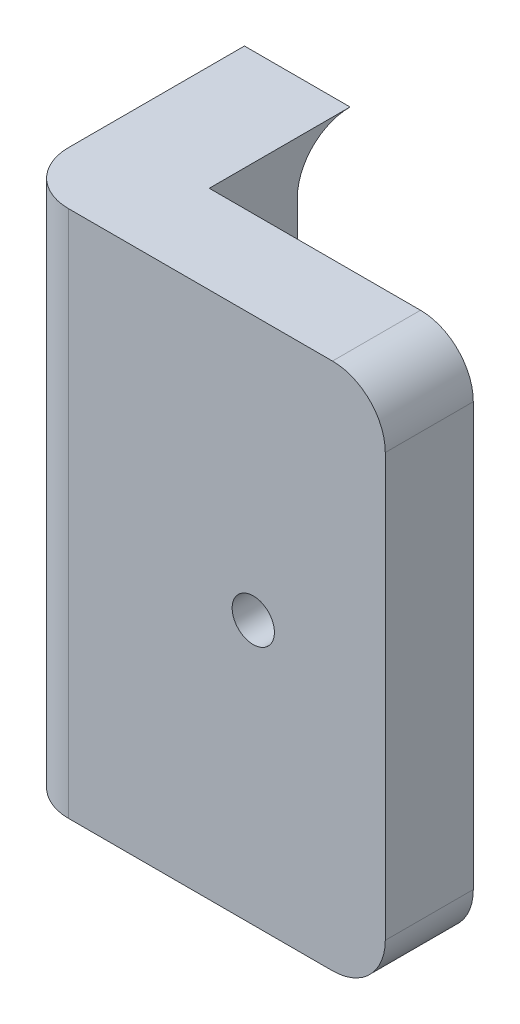
ISO-10303-21;
HEADER;
FILE_DESCRIPTION(('STEP AP214'),'2;1');
FILE_NAME('part.step','',(''),(''),'','','');
FILE_SCHEMA(('AUTOMOTIVE_DESIGN { 1 0 10303 214 1 1 1 1 }'));
ENDSEC;
DATA;
#1=APPLICATION_CONTEXT('core data for automotive mechanical design processes');
#2=APPLICATION_PROTOCOL_DEFINITION('international standard','automotive_design',2000,#1);
#3=PRODUCT_CONTEXT('',#1,'mechanical');
#4=PRODUCT('Part','Part','',(#3));
#5=PRODUCT_RELATED_PRODUCT_CATEGORY('part','',(#4));
#6=PRODUCT_DEFINITION_FORMATION('','',#4);
#7=PRODUCT_DEFINITION_CONTEXT('part definition',#1,'design');
#8=PRODUCT_DEFINITION('design','',#6,#7);
#9=PRODUCT_DEFINITION_SHAPE('','',#8);
#10=(LENGTH_UNIT() NAMED_UNIT(*) SI_UNIT(.MILLI.,.METRE.));
#11=(NAMED_UNIT(*) PLANE_ANGLE_UNIT() SI_UNIT($,.RADIAN.));
#12=(NAMED_UNIT(*) SI_UNIT($,.STERADIAN.) SOLID_ANGLE_UNIT());
#13=UNCERTAINTY_MEASURE_WITH_UNIT(LENGTH_MEASURE(1.E-05),#10,'distance_accuracy_value','');
#14=(GEOMETRIC_REPRESENTATION_CONTEXT(3) GLOBAL_UNCERTAINTY_ASSIGNED_CONTEXT((#13)) GLOBAL_UNIT_ASSIGNED_CONTEXT((#10,
#11,#12)) REPRESENTATION_CONTEXT('',''));
#15=CARTESIAN_POINT('',(0.,0.,0.));
#16=DIRECTION('',(0.,0.,1.));
#17=DIRECTION('',(1.,0.,0.));
#18=AXIS2_PLACEMENT_3D('',#15,#16,#17);
#19=CARTESIAN_POINT('',(6.,-33.0000000000001,-5.));
#20=DIRECTION('',(1.,0.,0.));
#21=DIRECTION('',(0.,0.,-1.));
#22=AXIS2_PLACEMENT_3D('',#19,#20,#21);
#23=PLANE('',#22);
#24=CARTESIAN_POINT('',(6.,-36.0000000000001,-3.));
#25=DIRECTION('',(1.,0.,0.));
#26=DIRECTION('',(0.,0.,-1.));
#27=AXIS2_PLACEMENT_3D('',#24,#25,#26);
#28=CIRCLE('',#27,3.);
#29=CARTESIAN_POINT('',(6.,-33.0000000000001,-3.));
#30=VERTEX_POINT('',#29);
#31=CARTESIAN_POINT('',(6.,-36.0000000000001,0.));
#32=VERTEX_POINT('',#31);
#33=EDGE_CURVE('E122',#30,#32,#28,.T.);
#34=ORIENTED_EDGE('',*,*,#33,.F.);
#35=DIRECTION('',(0.,0.,1.));
#36=VECTOR('',#35,1.);
#37=CARTESIAN_POINT('',(6.,-33.0000000000001,-5.));
#38=LINE('',#37,#36);
#39=CARTESIAN_POINT('',(6.,-33.0000000000001,5.));
#40=VERTEX_POINT('',#39);
#41=EDGE_CURVE('E166',#30,#40,#38,.T.);
#42=ORIENTED_EDGE('',*,*,#41,.T.);
#43=DIRECTION('',(0.,1.,0.));
#44=VECTOR('',#43,1.);
#45=CARTESIAN_POINT('',(6.,-63.0000000000001,5.));
#46=LINE('',#45,#44);
#47=CARTESIAN_POINT('',(6.,-63.0000000000001,5.));
#48=VERTEX_POINT('',#47);
#49=EDGE_CURVE('E145',#48,#40,#46,.T.);
#50=ORIENTED_EDGE('',*,*,#49,.F.);
#51=DIRECTION('',(0.,0.,1.));
#52=VECTOR('',#51,1.);
#53=CARTESIAN_POINT('',(6.,-63.0000000000001,-5.));
#54=LINE('',#53,#52);
#55=CARTESIAN_POINT('',(6.,-63.0000000000001,-3.));
#56=VERTEX_POINT('',#55);
#57=EDGE_CURVE('E167',#56,#48,#54,.T.);
#58=ORIENTED_EDGE('',*,*,#57,.F.);
#59=CARTESIAN_POINT('',(6.,-60.0000000000001,-3.));
#60=DIRECTION('',(1.,0.,0.));
#61=DIRECTION('',(0.,0.,-1.));
#62=AXIS2_PLACEMENT_3D('',#59,#60,#61);
#63=CIRCLE('',#62,3.);
#64=CARTESIAN_POINT('',(6.,-60.0000000000001,0.));
#65=VERTEX_POINT('',#64);
#66=EDGE_CURVE('E137',#65,#56,#63,.T.);
#67=ORIENTED_EDGE('',*,*,#66,.F.);
#68=DIRECTION('',(0.,-1.,0.));
#69=VECTOR('',#68,1.);
#70=CARTESIAN_POINT('',(6.,-33.0000000000001,0.));
#71=LINE('',#70,#69);
#72=EDGE_CURVE('E129',#32,#65,#71,.T.);
#73=ORIENTED_EDGE('',*,*,#72,.F.);
#74=EDGE_LOOP('',(#34,#42,#50,#58,#67,#73));
#75=FACE_BOUND('',#74,.T.);
#76=ADVANCED_FACE('F32',(#75),#23,.T.);
#77=CARTESIAN_POINT('',(6.,-63.0000000000001,-5.));
#78=DIRECTION('',(0.,-1.,0.));
#79=DIRECTION('',(0.,0.,-1.));
#80=AXIS2_PLACEMENT_3D('',#77,#78,#79);
#81=PLANE('',#80);
#82=DIRECTION('',(-1.,0.,0.));
#83=VECTOR('',#82,1.);
#84=CARTESIAN_POINT('',(6.,-63.0000000000001,-3.));
#85=LINE('',#84,#83);
#86=CARTESIAN_POINT('',(0.,-63.0000000000001,-3.));
#87=VERTEX_POINT('',#86);
#88=EDGE_CURVE('E143',#56,#87,#85,.T.);
#89=ORIENTED_EDGE('',*,*,#88,.F.);
#90=ORIENTED_EDGE('',*,*,#57,.T.);
#91=DIRECTION('',(-1.,0.,0.));
#92=VECTOR('',#91,1.);
#93=CARTESIAN_POINT('',(21.,-63.0000000000001,5.));
#94=LINE('',#93,#92);
#95=CARTESIAN_POINT('',(18.,-63.0000000000001,5.));
#96=VERTEX_POINT('',#95);
#97=EDGE_CURVE('E157',#96,#48,#94,.T.);
#98=ORIENTED_EDGE('',*,*,#97,.F.);
#99=DIRECTION('',(0.,0.,-1.));
#100=VECTOR('',#99,1.);
#101=CARTESIAN_POINT('',(18.,-63.0000000000001,10.));
#102=LINE('',#101,#100);
#103=CARTESIAN_POINT('',(18.,-63.0000000000001,10.));
#104=VERTEX_POINT('',#103);
#105=EDGE_CURVE('E40',#96,#104,#102,.F.);
#106=ORIENTED_EDGE('',*,*,#105,.T.);
#107=DIRECTION('',(1.,0.,0.));
#108=VECTOR('',#107,1.);
#109=CARTESIAN_POINT('',(6.,-63.0000000000001,10.));
#110=LINE('',#109,#108);
#111=CARTESIAN_POINT('',(3.,-63.0000000000001,10.));
#112=VERTEX_POINT('',#111);
#113=EDGE_CURVE('E163',#112,#104,#110,.T.);
#114=ORIENTED_EDGE('',*,*,#113,.F.);
#115=CARTESIAN_POINT('',(3.,-63.0000000000001,7.));
#116=DIRECTION('',(0.,-1.,0.));
#117=DIRECTION('',(0.,0.,-1.));
#118=AXIS2_PLACEMENT_3D('',#115,#116,#117);
#119=CIRCLE('',#118,3.);
#120=CARTESIAN_POINT('',(0.,-63.0000000000001,7.));
#121=VERTEX_POINT('',#120);
#122=EDGE_CURVE('E193',#112,#121,#119,.T.);
#123=ORIENTED_EDGE('',*,*,#122,.T.);
#124=DIRECTION('',(0.,0.,1.));
#125=VECTOR('',#124,1.);
#126=CARTESIAN_POINT('',(0.,-63.0000000000001,-5.));
#127=LINE('',#126,#125);
#128=EDGE_CURVE('E54',#87,#121,#127,.T.);
#129=ORIENTED_EDGE('',*,*,#128,.F.);
#130=EDGE_LOOP('',(#89,#90,#98,#106,#114,#123,#129));
#131=FACE_BOUND('',#130,.T.);
#132=ADVANCED_FACE('F199',(#131),#81,.T.);
#133=CARTESIAN_POINT('',(0.,-33.0000000000001,-5.));
#134=DIRECTION('',(-1.,0.,0.));
#135=DIRECTION('',(0.,-1.,0.));
#136=AXIS2_PLACEMENT_3D('',#133,#134,#135);
#137=PLANE('',#136);
#138=CARTESIAN_POINT('',(0.,-60.0000000000001,-3.));
#139=DIRECTION('',(1.,0.,0.));
#140=DIRECTION('',(0.,0.,-1.));
#141=AXIS2_PLACEMENT_3D('',#138,#139,#140);
#142=CIRCLE('',#141,3.);
#143=CARTESIAN_POINT('',(0.,-60.0000000000001,0.));
#144=VERTEX_POINT('',#143);
#145=EDGE_CURVE('E124',#87,#144,#142,.F.);
#146=ORIENTED_EDGE('',*,*,#145,.F.);
#147=ORIENTED_EDGE('',*,*,#128,.T.);
#148=DIRECTION('',(0.,-1.,0.));
#149=VECTOR('',#148,1.);
#150=CARTESIAN_POINT('',(0.,-33.0000000000001,7.));
#151=LINE('',#150,#149);
#152=CARTESIAN_POINT('',(0.,-33.0000000000001,7.));
#153=VERTEX_POINT('',#152);
#154=EDGE_CURVE('E11',#121,#153,#151,.F.);
#155=ORIENTED_EDGE('',*,*,#154,.T.);
#156=DIRECTION('',(0.,0.,1.));
#157=VECTOR('',#156,1.);
#158=CARTESIAN_POINT('',(0.,-33.0000000000001,-5.));
#159=LINE('',#158,#157);
#160=CARTESIAN_POINT('',(0.,-33.0000000000001,-3.));
#161=VERTEX_POINT('',#160);
#162=EDGE_CURVE('E134',#161,#153,#159,.T.);
#163=ORIENTED_EDGE('',*,*,#162,.F.);
#164=CARTESIAN_POINT('',(0.,-36.0000000000001,-3.));
#165=DIRECTION('',(1.,0.,0.));
#166=DIRECTION('',(0.,0.,-1.));
#167=AXIS2_PLACEMENT_3D('',#164,#165,#166);
#168=CIRCLE('',#167,3.);
#169=CARTESIAN_POINT('',(0.,-36.0000000000001,0.));
#170=VERTEX_POINT('',#169);
#171=EDGE_CURVE('E119',#170,#161,#168,.F.);
#172=ORIENTED_EDGE('',*,*,#171,.F.);
#173=DIRECTION('',(0.,-1.,0.));
#174=VECTOR('',#173,1.);
#175=CARTESIAN_POINT('',(0.,-33.0000000000001,0.));
#176=LINE('',#175,#174);
#177=EDGE_CURVE('E127',#170,#144,#176,.T.);
#178=ORIENTED_EDGE('',*,*,#177,.T.);
#179=EDGE_LOOP('',(#146,#147,#155,#163,#172,#178));
#180=FACE_BOUND('',#179,.T.);
#181=ADVANCED_FACE('F133',(#180),#137,.T.);
#182=CARTESIAN_POINT('',(0.,-33.0000000000001,-5.));
#183=DIRECTION('',(0.,1.,0.));
#184=DIRECTION('',(0.,0.,1.));
#185=AXIS2_PLACEMENT_3D('',#182,#183,#184);
#186=PLANE('',#185);
#187=DIRECTION('',(-1.,0.,0.));
#188=VECTOR('',#187,1.);
#189=CARTESIAN_POINT('',(6.,-33.0000000000001,-3.));
#190=LINE('',#189,#188);
#191=EDGE_CURVE('E135',#161,#30,#190,.F.);
#192=ORIENTED_EDGE('',*,*,#191,.F.);
#193=ORIENTED_EDGE('',*,*,#162,.T.);
#194=CARTESIAN_POINT('',(3.,-33.0000000000001,7.));
#195=DIRECTION('',(0.,1.,0.));
#196=DIRECTION('',(0.,0.,1.));
#197=AXIS2_PLACEMENT_3D('',#194,#195,#196);
#198=CIRCLE('',#197,3.);
#199=CARTESIAN_POINT('',(3.,-33.0000000000001,10.));
#200=VERTEX_POINT('',#199);
#201=EDGE_CURVE('E185',#153,#200,#198,.T.);
#202=ORIENTED_EDGE('',*,*,#201,.T.);
#203=DIRECTION('',(-1.,0.,0.));
#204=VECTOR('',#203,1.);
#205=CARTESIAN_POINT('',(0.,-33.0000000000001,10.));
#206=LINE('',#205,#204);
#207=CARTESIAN_POINT('',(18.,-33.0000000000001,10.));
#208=VERTEX_POINT('',#207);
#209=EDGE_CURVE('E160',#208,#200,#206,.T.);
#210=ORIENTED_EDGE('',*,*,#209,.F.);
#211=DIRECTION('',(0.,0.,1.));
#212=VECTOR('',#211,1.);
#213=CARTESIAN_POINT('',(18.,-33.0000000000001,5.));
#214=LINE('',#213,#212);
#215=CARTESIAN_POINT('',(18.,-33.0000000000001,5.));
#216=VERTEX_POINT('',#215);
#217=EDGE_CURVE('E187',#208,#216,#214,.F.);
#218=ORIENTED_EDGE('',*,*,#217,.T.);
#219=DIRECTION('',(-1.,0.,0.));
#220=VECTOR('',#219,1.);
#221=CARTESIAN_POINT('',(21.,-33.0000000000001,5.));
#222=LINE('',#221,#220);
#223=EDGE_CURVE('E152',#216,#40,#222,.T.);
#224=ORIENTED_EDGE('',*,*,#223,.T.);
#225=ORIENTED_EDGE('',*,*,#41,.F.);
#226=EDGE_LOOP('',(#192,#193,#202,#210,#218,#224,#225));
#227=FACE_BOUND('',#226,.T.);
#228=ADVANCED_FACE('F221',(#227),#186,.T.);
#229=CARTESIAN_POINT('',(0.,0.,10.));
#230=DIRECTION('',(0.,0.,-1.));
#231=DIRECTION('',(-1.,0.,0.));
#232=AXIS2_PLACEMENT_3D('',#229,#230,#231);
#233=PLANE('',#232);
#234=CARTESIAN_POINT('',(13.5,-48.0000000000002,10.));
#235=DIRECTION('',(0.,0.,1.));
#236=DIRECTION('',(1.,0.,0.));
#237=AXIS2_PLACEMENT_3D('',#234,#235,#236);
#238=CIRCLE('',#237,1.2);
#239=CARTESIAN_POINT('',(14.7,-48.0000000000002,10.));
#240=VERTEX_POINT('',#239);
#241=EDGE_CURVE('E234',#240,#240,#238,.T.);
#242=ORIENTED_EDGE('',*,*,#241,.F.);
#243=EDGE_LOOP('',(#242));
#244=FACE_BOUND('',#243,.T.);
#245=DIRECTION('',(0.,-1.,0.));
#246=VECTOR('',#245,1.);
#247=CARTESIAN_POINT('',(21.,-63.0000000000001,10.));
#248=LINE('',#247,#246);
#249=CARTESIAN_POINT('',(21.,-36.0000000000001,10.));
#250=VERTEX_POINT('',#249);
#251=CARTESIAN_POINT('',(21.,-60.0000000000001,10.));
#252=VERTEX_POINT('',#251);
#253=EDGE_CURVE('E146',#250,#252,#248,.T.);
#254=ORIENTED_EDGE('',*,*,#253,.F.);
#255=CARTESIAN_POINT('',(18.,-36.0000000000001,10.));
#256=DIRECTION('',(0.,0.,-1.));
#257=DIRECTION('',(-1.,0.,0.));
#258=AXIS2_PLACEMENT_3D('',#255,#256,#257);
#259=CIRCLE('',#258,3.);
#260=EDGE_CURVE('E183',#250,#208,#259,.F.);
#261=ORIENTED_EDGE('',*,*,#260,.T.);
#262=ORIENTED_EDGE('',*,*,#209,.T.);
#263=DIRECTION('',(0.,-1.,0.));
#264=VECTOR('',#263,1.);
#265=CARTESIAN_POINT('',(3.,-63.0000000000001,10.));
#266=LINE('',#265,#264);
#267=EDGE_CURVE('E178',#200,#112,#266,.T.);
#268=ORIENTED_EDGE('',*,*,#267,.T.);
#269=ORIENTED_EDGE('',*,*,#113,.T.);
#270=CARTESIAN_POINT('',(18.,-60.0000000000001,10.));
#271=DIRECTION('',(0.,0.,-1.));
#272=DIRECTION('',(-1.,0.,0.));
#273=AXIS2_PLACEMENT_3D('',#270,#271,#272);
#274=CIRCLE('',#273,3.);
#275=EDGE_CURVE('E181',#104,#252,#274,.F.);
#276=ORIENTED_EDGE('',*,*,#275,.T.);
#277=EDGE_LOOP('',(#254,#261,#262,#268,#269,#276));
#278=FACE_BOUND('',#277,.T.);
#279=ADVANCED_FACE('F204',(#244,#278),#233,.F.);
#280=CARTESIAN_POINT('',(21.,-63.0000000000001,5.));
#281=DIRECTION('',(0.,0.,1.));
#282=DIRECTION('',(1.,0.,0.));
#283=AXIS2_PLACEMENT_3D('',#280,#281,#282);
#284=PLANE('',#283);
#285=ORIENTED_EDGE('',*,*,#223,.F.);
#286=CARTESIAN_POINT('',(18.,-36.0000000000001,5.));
#287=DIRECTION('',(0.,0.,1.));
#288=DIRECTION('',(1.,0.,0.));
#289=AXIS2_PLACEMENT_3D('',#286,#287,#288);
#290=CIRCLE('',#289,3.);
#291=CARTESIAN_POINT('',(21.,-36.0000000000001,5.));
#292=VERTEX_POINT('',#291);
#293=EDGE_CURVE('E191',#216,#292,#290,.F.);
#294=ORIENTED_EDGE('',*,*,#293,.T.);
#295=DIRECTION('',(0.,1.,0.));
#296=VECTOR('',#295,1.);
#297=CARTESIAN_POINT('',(21.,-63.0000000000001,5.));
#298=LINE('',#297,#296);
#299=CARTESIAN_POINT('',(21.,-60.0000000000001,5.));
#300=VERTEX_POINT('',#299);
#301=EDGE_CURVE('E149',#300,#292,#298,.T.);
#302=ORIENTED_EDGE('',*,*,#301,.F.);
#303=CARTESIAN_POINT('',(18.,-60.0000000000001,5.));
#304=DIRECTION('',(0.,0.,1.));
#305=DIRECTION('',(1.,0.,0.));
#306=AXIS2_PLACEMENT_3D('',#303,#304,#305);
#307=CIRCLE('',#306,3.);
#308=EDGE_CURVE('E189',#300,#96,#307,.F.);
#309=ORIENTED_EDGE('',*,*,#308,.T.);
#310=ORIENTED_EDGE('',*,*,#97,.T.);
#311=ORIENTED_EDGE('',*,*,#49,.T.);
#312=EDGE_LOOP('',(#285,#294,#302,#309,#310,#311));
#313=FACE_BOUND('',#312,.T.);
#314=ADVANCED_FACE('F214',(#313),#284,.F.);
#315=CARTESIAN_POINT('',(21.,0.,0.));
#316=DIRECTION('',(-1.,0.,0.));
#317=DIRECTION('',(0.,0.,1.));
#318=AXIS2_PLACEMENT_3D('',#315,#316,#317);
#319=PLANE('',#318);
#320=ORIENTED_EDGE('',*,*,#301,.T.);
#321=DIRECTION('',(0.,0.,1.));
#322=VECTOR('',#321,1.);
#323=CARTESIAN_POINT('',(21.,-36.0000000000001,10.));
#324=LINE('',#323,#322);
#325=EDGE_CURVE('E175',#292,#250,#324,.T.);
#326=ORIENTED_EDGE('',*,*,#325,.T.);
#327=ORIENTED_EDGE('',*,*,#253,.T.);
#328=DIRECTION('',(0.,0.,-1.));
#329=VECTOR('',#328,1.);
#330=CARTESIAN_POINT('',(21.,-60.0000000000001,5.));
#331=LINE('',#330,#329);
#332=EDGE_CURVE('E169',#252,#300,#331,.T.);
#333=ORIENTED_EDGE('',*,*,#332,.T.);
#334=EDGE_LOOP('',(#320,#326,#327,#333));
#335=FACE_BOUND('',#334,.T.);
#336=ADVANCED_FACE('F210',(#335),#319,.F.);
#337=CARTESIAN_POINT('',(18.,-36.0000000000001,0.));
#338=DIRECTION('',(0.,0.,-1.));
#339=DIRECTION('',(-1.,0.,0.));
#340=AXIS2_PLACEMENT_3D('',#337,#338,#339);
#341=CYLINDRICAL_SURFACE('',#340,3.);
#342=ORIENTED_EDGE('',*,*,#293,.F.);
#343=ORIENTED_EDGE('',*,*,#217,.F.);
#344=ORIENTED_EDGE('',*,*,#260,.F.);
#345=ORIENTED_EDGE('',*,*,#325,.F.);
#346=EDGE_LOOP('',(#342,#343,#344,#345));
#347=FACE_BOUND('',#346,.T.);
#348=ADVANCED_FACE('F218',(#347),#341,.T.);
#349=CARTESIAN_POINT('',(18.,-60.0000000000001,0.));
#350=DIRECTION('',(0.,0.,1.));
#351=DIRECTION('',(1.,0.,0.));
#352=AXIS2_PLACEMENT_3D('',#349,#350,#351);
#353=CYLINDRICAL_SURFACE('',#352,3.);
#354=ORIENTED_EDGE('',*,*,#275,.F.);
#355=ORIENTED_EDGE('',*,*,#105,.F.);
#356=ORIENTED_EDGE('',*,*,#308,.F.);
#357=ORIENTED_EDGE('',*,*,#332,.F.);
#358=EDGE_LOOP('',(#354,#355,#356,#357));
#359=FACE_BOUND('',#358,.T.);
#360=ADVANCED_FACE('F207',(#359),#353,.T.);
#361=CARTESIAN_POINT('',(3.,0.,7.));
#362=DIRECTION('',(0.,1.,0.));
#363=DIRECTION('',(-1.,0.,0.));
#364=AXIS2_PLACEMENT_3D('',#361,#362,#363);
#365=CYLINDRICAL_SURFACE('',#364,3.);
#366=ORIENTED_EDGE('',*,*,#201,.F.);
#367=ORIENTED_EDGE('',*,*,#154,.F.);
#368=ORIENTED_EDGE('',*,*,#122,.F.);
#369=ORIENTED_EDGE('',*,*,#267,.F.);
#370=EDGE_LOOP('',(#366,#367,#368,#369));
#371=FACE_BOUND('',#370,.T.);
#372=ADVANCED_FACE('F34',(#371),#365,.T.);
#373=CARTESIAN_POINT('',(6.,-33.0000000000001,0.));
#374=DIRECTION('',(0.,0.,-1.));
#375=DIRECTION('',(-1.,0.,0.));
#376=AXIS2_PLACEMENT_3D('',#373,#374,#375);
#377=PLANE('',#376);
#378=ORIENTED_EDGE('',*,*,#72,.T.);
#379=DIRECTION('',(-1.,0.,0.));
#380=VECTOR('',#379,1.);
#381=CARTESIAN_POINT('',(6.,-60.0000000000001,0.));
#382=LINE('',#381,#380);
#383=EDGE_CURVE('E47',#144,#65,#382,.F.);
#384=ORIENTED_EDGE('',*,*,#383,.F.);
#385=ORIENTED_EDGE('',*,*,#177,.F.);
#386=DIRECTION('',(-1.,0.,0.));
#387=VECTOR('',#386,1.);
#388=CARTESIAN_POINT('',(6.,-36.0000000000001,0.));
#389=LINE('',#388,#387);
#390=EDGE_CURVE('E116',#32,#170,#389,.T.);
#391=ORIENTED_EDGE('',*,*,#390,.F.);
#392=EDGE_LOOP('',(#378,#384,#385,#391));
#393=FACE_BOUND('',#392,.T.);
#394=ADVANCED_FACE('F128',(#393),#377,.T.);
#395=CARTESIAN_POINT('',(6.,-36.0000000000001,-3.));
#396=DIRECTION('',(-1.,0.,0.));
#397=DIRECTION('',(0.,0.,1.));
#398=AXIS2_PLACEMENT_3D('',#395,#396,#397);
#399=CYLINDRICAL_SURFACE('',#398,3.);
#400=ORIENTED_EDGE('',*,*,#33,.T.);
#401=ORIENTED_EDGE('',*,*,#390,.T.);
#402=ORIENTED_EDGE('',*,*,#171,.T.);
#403=ORIENTED_EDGE('',*,*,#191,.T.);
#404=EDGE_LOOP('',(#400,#401,#402,#403));
#405=FACE_BOUND('',#404,.T.);
#406=ADVANCED_FACE('F117',(#405),#399,.F.);
#407=CARTESIAN_POINT('',(6.,-60.0000000000001,-3.));
#408=DIRECTION('',(-1.,0.,0.));
#409=DIRECTION('',(0.,0.,1.));
#410=AXIS2_PLACEMENT_3D('',#407,#408,#409);
#411=CYLINDRICAL_SURFACE('',#410,3.);
#412=ORIENTED_EDGE('',*,*,#66,.T.);
#413=ORIENTED_EDGE('',*,*,#88,.T.);
#414=ORIENTED_EDGE('',*,*,#145,.T.);
#415=ORIENTED_EDGE('',*,*,#383,.T.);
#416=EDGE_LOOP('',(#412,#413,#414,#415));
#417=FACE_BOUND('',#416,.T.);
#418=ADVANCED_FACE('F245',(#417),#411,.F.);
#419=CARTESIAN_POINT('',(13.5,-48.0000000000002,6.));
#420=DIRECTION('',(0.,0.,1.));
#421=DIRECTION('',(1.,0.,0.));
#422=AXIS2_PLACEMENT_3D('',#419,#420,#421);
#423=CYLINDRICAL_SURFACE('',#422,1.2);
#424=CARTESIAN_POINT('',(13.5,-48.0000000000002,6.));
#425=DIRECTION('',(0.,0.,1.));
#426=DIRECTION('',(1.,0.,0.));
#427=AXIS2_PLACEMENT_3D('',#424,#425,#426);
#428=CIRCLE('',#427,1.2);
#429=CARTESIAN_POINT('',(14.7,-48.0000000000002,6.));
#430=VERTEX_POINT('',#429);
#431=EDGE_CURVE('E130',#430,#430,#428,.T.);
#432=ORIENTED_EDGE('',*,*,#431,.F.);
#433=EDGE_LOOP('',(#432));
#434=FACE_BOUND('',#433,.T.);
#435=ORIENTED_EDGE('',*,*,#241,.T.);
#436=EDGE_LOOP('',(#435));
#437=FACE_BOUND('',#436,.T.);
#438=ADVANCED_FACE('F242',(#434,#437),#423,.F.);
#439=CARTESIAN_POINT('',(13.5,-48.0000000000002,6.));
#440=DIRECTION('',(0.,0.,1.));
#441=DIRECTION('',(1.,0.,0.));
#442=AXIS2_PLACEMENT_3D('',#439,#440,#441);
#443=PLANE('',#442);
#444=ORIENTED_EDGE('',*,*,#431,.T.);
#445=EDGE_LOOP('',(#444));
#446=FACE_BOUND('',#445,.T.);
#447=ADVANCED_FACE('F240',(#446),#443,.T.);
#448=CLOSED_SHELL('',(#76,#132,#181,#228,#279,#314,#336,#348,#360,#372,#394,#406,#418,#438,#447));
#449=MANIFOLD_SOLID_BREP('B2',#448);
#450=ADVANCED_BREP_SHAPE_REPRESENTATION('',(#18,#449),#14);
#451=SHAPE_DEFINITION_REPRESENTATION(#9,#450);
ENDSEC;
END-ISO-10303-21;
